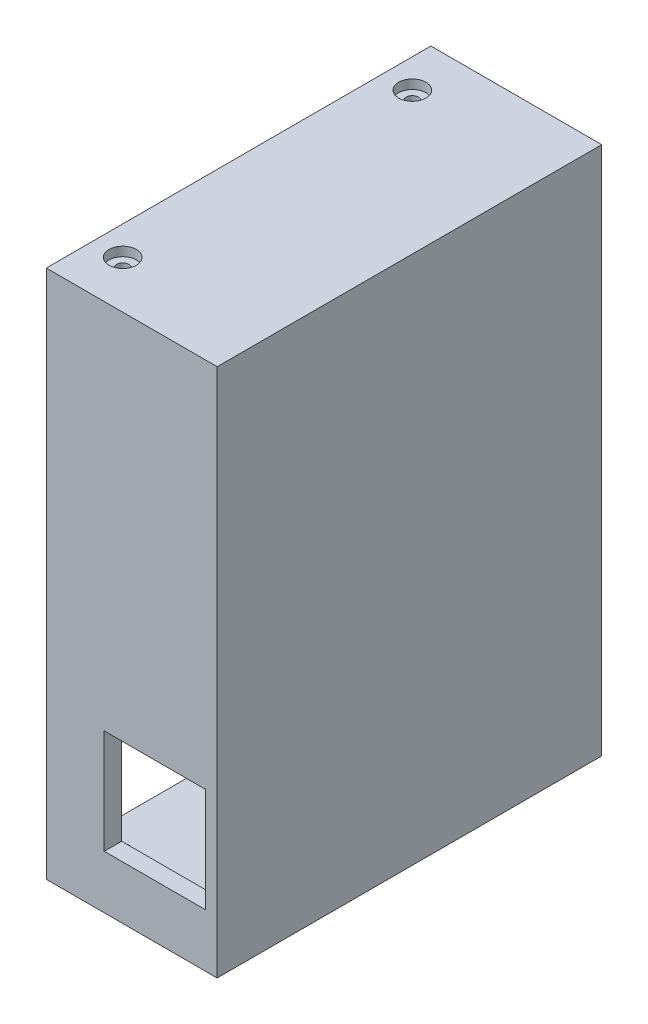
ISO-10303-21;
HEADER;
FILE_DESCRIPTION(('STEP AP214'),'2;1');
FILE_NAME('part.step','',(''),(''),'','','');
FILE_SCHEMA(('AUTOMOTIVE_DESIGN { 1 0 10303 214 1 1 1 1 }'));
ENDSEC;
DATA;
#1=APPLICATION_CONTEXT('core data for automotive mechanical design processes');
#2=APPLICATION_PROTOCOL_DEFINITION('international standard','automotive_design',2000,#1);
#3=PRODUCT_CONTEXT('',#1,'mechanical');
#4=PRODUCT('Part','Part','',(#3));
#5=PRODUCT_RELATED_PRODUCT_CATEGORY('part','',(#4));
#6=PRODUCT_DEFINITION_FORMATION('','',#4);
#7=PRODUCT_DEFINITION_CONTEXT('part definition',#1,'design');
#8=PRODUCT_DEFINITION('design','',#6,#7);
#9=PRODUCT_DEFINITION_SHAPE('','',#8);
#10=(LENGTH_UNIT() NAMED_UNIT(*) SI_UNIT(.MILLI.,.METRE.));
#11=(NAMED_UNIT(*) PLANE_ANGLE_UNIT() SI_UNIT($,.RADIAN.));
#12=(NAMED_UNIT(*) SI_UNIT($,.STERADIAN.) SOLID_ANGLE_UNIT());
#13=UNCERTAINTY_MEASURE_WITH_UNIT(LENGTH_MEASURE(1.E-05),#10,'distance_accuracy_value','');
#14=(GEOMETRIC_REPRESENTATION_CONTEXT(3) GLOBAL_UNCERTAINTY_ASSIGNED_CONTEXT((#13)) GLOBAL_UNIT_ASSIGNED_CONTEXT((#10,
#11,#12)) REPRESENTATION_CONTEXT('',''));
#15=CARTESIAN_POINT('',(0.,0.,0.));
#16=DIRECTION('',(0.,0.,1.));
#17=DIRECTION('',(1.,0.,0.));
#18=AXIS2_PLACEMENT_3D('',#15,#16,#17);
#19=CARTESIAN_POINT('',(2.54,58.035000008,42.160000008));
#20=DIRECTION('',(0.,0.,-1.));
#21=DIRECTION('',(0.,1.,0.));
#22=AXIS2_PLACEMENT_3D('',#19,#20,#21);
#23=PLANE('',#22);
#24=DIRECTION('',(-1.,0.,0.));
#25=VECTOR('',#24,1.);
#26=CARTESIAN_POINT('',(2.54,58.035000008,42.160000008));
#27=LINE('',#26,#25);
#28=CARTESIAN_POINT('',(2.54,58.035000008,42.160000008));
#29=VERTEX_POINT('',#28);
#30=CARTESIAN_POINT('',(-34.925,58.035000008,42.160000008));
#31=VERTEX_POINT('',#30);
#32=EDGE_CURVE('E351',#29,#31,#27,.T.);
#33=ORIENTED_EDGE('',*,*,#32,.T.);
#34=DIRECTION('',(0.,1.,0.));
#35=VECTOR('',#34,1.);
#36=CARTESIAN_POINT('',(-34.925,-58.035000008,42.160000008));
#37=LINE('',#36,#35);
#38=CARTESIAN_POINT('',(-34.925,-58.035000008,42.160000008));
#39=VERTEX_POINT('',#38);
#40=EDGE_CURVE('E302',#39,#31,#37,.T.);
#41=ORIENTED_EDGE('',*,*,#40,.F.);
#42=DIRECTION('',(-1.,0.,0.));
#43=VECTOR('',#42,1.);
#44=CARTESIAN_POINT('',(2.54,-58.035000008,42.160000008));
#45=LINE('',#44,#43);
#46=CARTESIAN_POINT('',(2.54,-58.035000008,42.160000008));
#47=VERTEX_POINT('',#46);
#48=EDGE_CURVE('E349',#47,#39,#45,.T.);
#49=ORIENTED_EDGE('',*,*,#48,.F.);
#50=DIRECTION('',(0.,-1.,0.));
#51=VECTOR('',#50,1.);
#52=CARTESIAN_POINT('',(2.54,58.035000008,42.160000008));
#53=LINE('',#52,#51);
#54=EDGE_CURVE('E339',#29,#47,#53,.T.);
#55=ORIENTED_EDGE('',*,*,#54,.F.);
#56=EDGE_LOOP('',(#33,#41,#49,#55));
#57=FACE_BOUND('',#56,.T.);
#58=DIRECTION('',(0.,1.,0.));
#59=VECTOR('',#58,1.);
#60=CARTESIAN_POINT('',(0.,-23.495,42.160000008));
#61=LINE('',#60,#59);
#62=CARTESIAN_POINT('',(0.,-46.355,42.160000008));
#63=VERTEX_POINT('',#62);
#64=CARTESIAN_POINT('',(0.,-23.495,42.160000008));
#65=VERTEX_POINT('',#64);
#66=EDGE_CURVE('E175',#63,#65,#61,.T.);
#67=ORIENTED_EDGE('',*,*,#66,.F.);
#68=DIRECTION('',(1.,0.,0.));
#69=VECTOR('',#68,1.);
#70=CARTESIAN_POINT('',(0.,-46.355,42.160000008));
#71=LINE('',#70,#69);
#72=CARTESIAN_POINT('',(-22.225,-46.355,42.160000008));
#73=VERTEX_POINT('',#72);
#74=EDGE_CURVE('E198',#73,#63,#71,.T.);
#75=ORIENTED_EDGE('',*,*,#74,.F.);
#76=DIRECTION('',(0.,-1.,0.));
#77=VECTOR('',#76,1.);
#78=CARTESIAN_POINT('',(-22.225,-23.495,42.160000008));
#79=LINE('',#78,#77);
#80=CARTESIAN_POINT('',(-22.225,-23.495,42.160000008));
#81=VERTEX_POINT('',#80);
#82=EDGE_CURVE('E196',#81,#73,#79,.T.);
#83=ORIENTED_EDGE('',*,*,#82,.F.);
#84=DIRECTION('',(-1.,0.,0.));
#85=VECTOR('',#84,1.);
#86=CARTESIAN_POINT('',(0.,-23.495,42.160000008));
#87=LINE('',#86,#85);
#88=EDGE_CURVE('E184',#65,#81,#87,.T.);
#89=ORIENTED_EDGE('',*,*,#88,.F.);
#90=EDGE_LOOP('',(#67,#75,#83,#89));
#91=FACE_BOUND('',#90,.T.);
#92=ADVANCED_FACE('F39',(#57,#91),#23,.F.);
#93=CARTESIAN_POINT('',(-178.389655251433,-54.225000008,38.350000008));
#94=DIRECTION('',(0.,0.,-1.));
#95=DIRECTION('',(0.,1.,0.));
#96=AXIS2_PLACEMENT_3D('',#93,#94,#95);
#97=PLANE('',#96);
#98=DIRECTION('',(0.,1.,0.));
#99=VECTOR('',#98,1.);
#100=CARTESIAN_POINT('',(0.,-54.225000008,38.350000008));
#101=LINE('',#100,#99);
#102=CARTESIAN_POINT('',(0.,-23.495,38.350000008));
#103=VERTEX_POINT('',#102);
#104=CARTESIAN_POINT('',(0.,54.225000008,38.350000008));
#105=VERTEX_POINT('',#104);
#106=EDGE_CURVE('E316',#103,#105,#101,.T.);
#107=ORIENTED_EDGE('',*,*,#106,.F.);
#108=DIRECTION('',(-1.,0.,0.));
#109=VECTOR('',#108,1.);
#110=CARTESIAN_POINT('',(-178.389655251433,-23.495,38.350000008));
#111=LINE('',#110,#109);
#112=CARTESIAN_POINT('',(-22.225,-23.495,38.350000008));
#113=VERTEX_POINT('',#112);
#114=EDGE_CURVE('E191',#103,#113,#111,.T.);
#115=ORIENTED_EDGE('',*,*,#114,.T.);
#116=DIRECTION('',(0.,-1.,0.));
#117=VECTOR('',#116,1.);
#118=CARTESIAN_POINT('',(-22.225,-54.225000008,38.350000008));
#119=LINE('',#118,#117);
#120=CARTESIAN_POINT('',(-22.225,-46.355,38.350000008));
#121=VERTEX_POINT('',#120);
#122=EDGE_CURVE('E11',#113,#121,#119,.T.);
#123=ORIENTED_EDGE('',*,*,#122,.T.);
#124=DIRECTION('',(1.,0.,0.));
#125=VECTOR('',#124,1.);
#126=CARTESIAN_POINT('',(-178.389655251433,-46.355,38.350000008));
#127=LINE('',#126,#125);
#128=CARTESIAN_POINT('',(0.,-46.355,38.350000008));
#129=VERTEX_POINT('',#128);
#130=EDGE_CURVE('E192',#121,#129,#127,.T.);
#131=ORIENTED_EDGE('',*,*,#130,.T.);
#132=CARTESIAN_POINT('',(0.,-54.225000008,38.350000008));
#133=VERTEX_POINT('',#132);
#134=EDGE_CURVE('E317',#133,#129,#101,.T.);
#135=ORIENTED_EDGE('',*,*,#134,.F.);
#136=DIRECTION('',(1.,0.,0.));
#137=VECTOR('',#136,1.);
#138=CARTESIAN_POINT('',(-178.389655251433,-54.225000008,38.350000008));
#139=LINE('',#138,#137);
#140=CARTESIAN_POINT('',(-34.925,-54.225000008,38.350000008));
#141=VERTEX_POINT('',#140);
#142=EDGE_CURVE('E327',#141,#133,#139,.T.);
#143=ORIENTED_EDGE('',*,*,#142,.F.);
#144=DIRECTION('',(0.,1.,0.));
#145=VECTOR('',#144,1.);
#146=CARTESIAN_POINT('',(-34.925,-54.225000008,38.350000008));
#147=LINE('',#146,#145);
#148=CARTESIAN_POINT('',(-34.925,54.225000008,38.350000008));
#149=VERTEX_POINT('',#148);
#150=EDGE_CURVE('E286',#141,#149,#147,.T.);
#151=ORIENTED_EDGE('',*,*,#150,.T.);
#152=DIRECTION('',(1.,0.,0.));
#153=VECTOR('',#152,1.);
#154=CARTESIAN_POINT('',(-178.389655251433,54.225000008,38.350000008));
#155=LINE('',#154,#153);
#156=EDGE_CURVE('E324',#149,#105,#155,.T.);
#157=ORIENTED_EDGE('',*,*,#156,.T.);
#158=EDGE_LOOP('',(#107,#115,#123,#131,#135,#143,#151,#157));
#159=FACE_BOUND('',#158,.T.);
#160=ADVANCED_FACE('F407',(#159),#97,.T.);
#161=CARTESIAN_POINT('',(2.54,-58.035000008,-42.160000008));
#162=DIRECTION('',(0.,1.,0.));
#163=DIRECTION('',(0.,0.,1.));
#164=AXIS2_PLACEMENT_3D('',#161,#162,#163);
#165=PLANE('',#164);
#166=ORIENTED_EDGE('',*,*,#48,.T.);
#167=DIRECTION('',(0.,0.,1.));
#168=VECTOR('',#167,1.);
#169=CARTESIAN_POINT('',(-34.925,-58.035000008,-42.160000008));
#170=LINE('',#169,#168);
#171=CARTESIAN_POINT('',(-34.925,-58.035000008,-42.160000008));
#172=VERTEX_POINT('',#171);
#173=EDGE_CURVE('E305',#172,#39,#170,.T.);
#174=ORIENTED_EDGE('',*,*,#173,.F.);
#175=DIRECTION('',(-1.,0.,0.));
#176=VECTOR('',#175,1.);
#177=CARTESIAN_POINT('',(2.54,-58.035000008,-42.160000008));
#178=LINE('',#177,#176);
#179=CARTESIAN_POINT('',(2.54,-58.035000008,-42.160000008));
#180=VERTEX_POINT('',#179);
#181=EDGE_CURVE('E347',#180,#172,#178,.T.);
#182=ORIENTED_EDGE('',*,*,#181,.F.);
#183=DIRECTION('',(0.,0.,-1.));
#184=VECTOR('',#183,1.);
#185=CARTESIAN_POINT('',(2.54,-58.035000008,-42.160000008));
#186=LINE('',#185,#184);
#187=EDGE_CURVE('E341',#47,#180,#186,.T.);
#188=ORIENTED_EDGE('',*,*,#187,.F.);
#189=EDGE_LOOP('',(#166,#174,#182,#188));
#190=FACE_BOUND('',#189,.T.);
#191=CARTESIAN_POINT('',(-28.575,-58.035000008,-31.75));
#192=DIRECTION('',(0.,-1.,0.));
#193=DIRECTION('',(0.,0.,-1.));
#194=AXIS2_PLACEMENT_3D('',#191,#192,#193);
#195=CIRCLE('',#194,2.999999969);
#196=CARTESIAN_POINT('',(-28.575,-58.035000008,-34.749999969));
#197=VERTEX_POINT('',#196);
#198=EDGE_CURVE('E267',#197,#197,#195,.T.);
#199=ORIENTED_EDGE('',*,*,#198,.F.);
#200=EDGE_LOOP('',(#199));
#201=FACE_BOUND('',#200,.T.);
#202=CARTESIAN_POINT('',(-28.575,-58.035000008,31.75));
#203=DIRECTION('',(0.,-1.,0.));
#204=DIRECTION('',(0.,0.,-1.));
#205=AXIS2_PLACEMENT_3D('',#202,#203,#204);
#206=CIRCLE('',#205,2.999999969);
#207=CARTESIAN_POINT('',(-28.575,-58.035000008,28.750000031));
#208=VERTEX_POINT('',#207);
#209=EDGE_CURVE('E264',#208,#208,#206,.T.);
#210=ORIENTED_EDGE('',*,*,#209,.F.);
#211=EDGE_LOOP('',(#210));
#212=FACE_BOUND('',#211,.T.);
#213=DIRECTION('',(0.,0.,1.));
#214=VECTOR('',#213,1.);
#215=CARTESIAN_POINT('',(0.,-58.035000008,0.));
#216=LINE('',#215,#214);
#217=CARTESIAN_POINT('',(0.,-58.035000008,-25.4));
#218=VERTEX_POINT('',#217);
#219=CARTESIAN_POINT('',(0.,-58.035000008,0.));
#220=VERTEX_POINT('',#219);
#221=EDGE_CURVE('E207',#218,#220,#216,.T.);
#222=ORIENTED_EDGE('',*,*,#221,.F.);
#223=DIRECTION('',(1.,0.,0.));
#224=VECTOR('',#223,1.);
#225=CARTESIAN_POINT('',(0.,-58.035000008,-25.4));
#226=LINE('',#225,#224);
#227=CARTESIAN_POINT('',(-22.225,-58.035000008,-25.4));
#228=VERTEX_POINT('',#227);
#229=EDGE_CURVE('E214',#228,#218,#226,.T.);
#230=ORIENTED_EDGE('',*,*,#229,.F.);
#231=DIRECTION('',(0.,0.,-1.));
#232=VECTOR('',#231,1.);
#233=CARTESIAN_POINT('',(-22.225,-58.035000008,0.));
#234=LINE('',#233,#232);
#235=CARTESIAN_POINT('',(-22.225,-58.035000008,0.));
#236=VERTEX_POINT('',#235);
#237=EDGE_CURVE('E211',#236,#228,#234,.T.);
#238=ORIENTED_EDGE('',*,*,#237,.F.);
#239=DIRECTION('',(-1.,0.,0.));
#240=VECTOR('',#239,1.);
#241=CARTESIAN_POINT('',(0.,-58.035000008,0.));
#242=LINE('',#241,#240);
#243=EDGE_CURVE('E209',#220,#236,#242,.T.);
#244=ORIENTED_EDGE('',*,*,#243,.F.);
#245=EDGE_LOOP('',(#222,#230,#238,#244));
#246=FACE_BOUND('',#245,.T.);
#247=ADVANCED_FACE('F390',(#190,#201,#212,#246),#165,.F.);
#248=CARTESIAN_POINT('',(-178.389655251433,-54.225000008,-38.350000008));
#249=DIRECTION('',(0.,1.,0.));
#250=DIRECTION('',(0.,0.,1.));
#251=AXIS2_PLACEMENT_3D('',#248,#249,#250);
#252=PLANE('',#251);
#253=CARTESIAN_POINT('',(-28.575,-54.225000008,31.75));
#254=DIRECTION('',(0.,1.,0.));
#255=DIRECTION('',(0.,0.,1.));
#256=AXIS2_PLACEMENT_3D('',#253,#254,#255);
#257=CIRCLE('',#256,1.349999967);
#258=CARTESIAN_POINT('',(-28.575,-54.225000008,33.099999967));
#259=VERTEX_POINT('',#258);
#260=EDGE_CURVE('E290',#259,#259,#257,.F.);
#261=ORIENTED_EDGE('',*,*,#260,.T.);
#262=EDGE_LOOP('',(#261));
#263=FACE_BOUND('',#262,.T.);
#264=CARTESIAN_POINT('',(-28.575,-54.225000008,-31.75));
#265=DIRECTION('',(0.,1.,0.));
#266=DIRECTION('',(0.,0.,1.));
#267=AXIS2_PLACEMENT_3D('',#264,#265,#266);
#268=CIRCLE('',#267,1.349999967);
#269=CARTESIAN_POINT('',(-28.575,-54.225000008,-30.400000033));
#270=VERTEX_POINT('',#269);
#271=EDGE_CURVE('E354',#270,#270,#268,.F.);
#272=ORIENTED_EDGE('',*,*,#271,.T.);
#273=EDGE_LOOP('',(#272));
#274=FACE_BOUND('',#273,.T.);
#275=DIRECTION('',(0.,0.,1.));
#276=VECTOR('',#275,1.);
#277=CARTESIAN_POINT('',(0.,-54.225000008,-38.350000008));
#278=LINE('',#277,#276);
#279=CARTESIAN_POINT('',(0.,-54.225000008,0.));
#280=VERTEX_POINT('',#279);
#281=EDGE_CURVE('E312',#280,#133,#278,.T.);
#282=ORIENTED_EDGE('',*,*,#281,.F.);
#283=DIRECTION('',(-1.,0.,0.));
#284=VECTOR('',#283,1.);
#285=CARTESIAN_POINT('',(-178.389655251433,-54.225000008,0.));
#286=LINE('',#285,#284);
#287=CARTESIAN_POINT('',(-22.225,-54.225000008,0.));
#288=VERTEX_POINT('',#287);
#289=EDGE_CURVE('E230',#280,#288,#286,.T.);
#290=ORIENTED_EDGE('',*,*,#289,.T.);
#291=DIRECTION('',(0.,0.,-1.));
#292=VECTOR('',#291,1.);
#293=CARTESIAN_POINT('',(-22.225,-54.225000008,-38.350000008));
#294=LINE('',#293,#292);
#295=CARTESIAN_POINT('',(-22.225,-54.225000008,-25.4));
#296=VERTEX_POINT('',#295);
#297=EDGE_CURVE('E47',#288,#296,#294,.T.);
#298=ORIENTED_EDGE('',*,*,#297,.T.);
#299=DIRECTION('',(1.,0.,0.));
#300=VECTOR('',#299,1.);
#301=CARTESIAN_POINT('',(-178.389655251433,-54.225000008,-25.4));
#302=LINE('',#301,#300);
#303=CARTESIAN_POINT('',(0.,-54.225000008,-25.4));
#304=VERTEX_POINT('',#303);
#305=EDGE_CURVE('E227',#296,#304,#302,.T.);
#306=ORIENTED_EDGE('',*,*,#305,.T.);
#307=CARTESIAN_POINT('',(0.,-54.225000008,-38.350000008));
#308=VERTEX_POINT('',#307);
#309=EDGE_CURVE('E313',#308,#304,#278,.T.);
#310=ORIENTED_EDGE('',*,*,#309,.F.);
#311=DIRECTION('',(1.,0.,0.));
#312=VECTOR('',#311,1.);
#313=CARTESIAN_POINT('',(-178.389655251433,-54.225000008,-38.350000008));
#314=LINE('',#313,#312);
#315=CARTESIAN_POINT('',(-34.925,-54.225000008,-38.350000008));
#316=VERTEX_POINT('',#315);
#317=EDGE_CURVE('E330',#316,#308,#314,.T.);
#318=ORIENTED_EDGE('',*,*,#317,.F.);
#319=DIRECTION('',(0.,0.,1.));
#320=VECTOR('',#319,1.);
#321=CARTESIAN_POINT('',(-34.925,-54.225000008,-38.350000008));
#322=LINE('',#321,#320);
#323=EDGE_CURVE('E289',#316,#141,#322,.T.);
#324=ORIENTED_EDGE('',*,*,#323,.T.);
#325=ORIENTED_EDGE('',*,*,#142,.T.);
#326=EDGE_LOOP('',(#282,#290,#298,#306,#310,#318,#324,#325));
#327=FACE_BOUND('',#326,.T.);
#328=ADVANCED_FACE('F378',(#263,#274,#327),#252,.T.);
#329=CARTESIAN_POINT('',(2.54,58.035000008,-42.160000008));
#330=DIRECTION('',(0.,0.,1.));
#331=DIRECTION('',(0.,-1.,0.));
#332=AXIS2_PLACEMENT_3D('',#329,#330,#331);
#333=PLANE('',#332);
#334=ORIENTED_EDGE('',*,*,#181,.T.);
#335=DIRECTION('',(0.,-1.,0.));
#336=VECTOR('',#335,1.);
#337=CARTESIAN_POINT('',(-34.925,-58.035000008,-42.160000008));
#338=LINE('',#337,#336);
#339=CARTESIAN_POINT('',(-34.925,58.035000008,-42.160000008));
#340=VERTEX_POINT('',#339);
#341=EDGE_CURVE('E296',#340,#172,#338,.T.);
#342=ORIENTED_EDGE('',*,*,#341,.F.);
#343=DIRECTION('',(-1.,0.,0.));
#344=VECTOR('',#343,1.);
#345=CARTESIAN_POINT('',(2.54,58.035000008,-42.160000008));
#346=LINE('',#345,#344);
#347=CARTESIAN_POINT('',(2.54,58.035000008,-42.160000008));
#348=VERTEX_POINT('',#347);
#349=EDGE_CURVE('E345',#348,#340,#346,.T.);
#350=ORIENTED_EDGE('',*,*,#349,.F.);
#351=DIRECTION('',(0.,1.,0.));
#352=VECTOR('',#351,1.);
#353=CARTESIAN_POINT('',(2.54,58.035000008,-42.160000008));
#354=LINE('',#353,#352);
#355=EDGE_CURVE('E343',#180,#348,#354,.T.);
#356=ORIENTED_EDGE('',*,*,#355,.F.);
#357=EDGE_LOOP('',(#334,#342,#350,#356));
#358=FACE_BOUND('',#357,.T.);
#359=DIRECTION('',(0.,-1.,0.));
#360=VECTOR('',#359,1.);
#361=CARTESIAN_POINT('',(0.,-46.355,-42.160000008));
#362=LINE('',#361,#360);
#363=CARTESIAN_POINT('',(0.,-23.495,-42.160000008));
#364=VERTEX_POINT('',#363);
#365=CARTESIAN_POINT('',(0.,-46.355,-42.160000008));
#366=VERTEX_POINT('',#365);
#367=EDGE_CURVE('E233',#364,#366,#362,.T.);
#368=ORIENTED_EDGE('',*,*,#367,.F.);
#369=DIRECTION('',(1.,0.,0.));
#370=VECTOR('',#369,1.);
#371=CARTESIAN_POINT('',(0.,-23.495,-42.160000008));
#372=LINE('',#371,#370);
#373=CARTESIAN_POINT('',(-22.225,-23.495,-42.160000008));
#374=VERTEX_POINT('',#373);
#375=EDGE_CURVE('E240',#374,#364,#372,.T.);
#376=ORIENTED_EDGE('',*,*,#375,.F.);
#377=DIRECTION('',(0.,1.,0.));
#378=VECTOR('',#377,1.);
#379=CARTESIAN_POINT('',(-22.225,-46.355,-42.160000008));
#380=LINE('',#379,#378);
#381=CARTESIAN_POINT('',(-22.225,-46.355,-42.160000008));
#382=VERTEX_POINT('',#381);
#383=EDGE_CURVE('E237',#382,#374,#380,.T.);
#384=ORIENTED_EDGE('',*,*,#383,.F.);
#385=DIRECTION('',(-1.,0.,0.));
#386=VECTOR('',#385,1.);
#387=CARTESIAN_POINT('',(0.,-46.355,-42.160000008));
#388=LINE('',#387,#386);
#389=EDGE_CURVE('E235',#366,#382,#388,.T.);
#390=ORIENTED_EDGE('',*,*,#389,.F.);
#391=EDGE_LOOP('',(#368,#376,#384,#390));
#392=FACE_BOUND('',#391,.T.);
#393=ADVANCED_FACE('F426',(#358,#392),#333,.F.);
#394=CARTESIAN_POINT('',(-178.389655251433,-54.225000008,-38.350000008));
#395=DIRECTION('',(0.,0.,1.));
#396=DIRECTION('',(0.,-1.,0.));
#397=AXIS2_PLACEMENT_3D('',#394,#395,#396);
#398=PLANE('',#397);
#399=DIRECTION('',(0.,-1.,0.));
#400=VECTOR('',#399,1.);
#401=CARTESIAN_POINT('',(0.,-54.225000008,-38.350000008));
#402=LINE('',#401,#400);
#403=CARTESIAN_POINT('',(0.,-46.355,-38.350000008));
#404=VERTEX_POINT('',#403);
#405=EDGE_CURVE('E308',#404,#308,#402,.T.);
#406=ORIENTED_EDGE('',*,*,#405,.F.);
#407=DIRECTION('',(-1.,0.,0.));
#408=VECTOR('',#407,1.);
#409=CARTESIAN_POINT('',(-178.389655251433,-46.355,-38.350000008));
#410=LINE('',#409,#408);
#411=CARTESIAN_POINT('',(-22.225,-46.355,-38.350000008));
#412=VERTEX_POINT('',#411);
#413=EDGE_CURVE('E256',#404,#412,#410,.T.);
#414=ORIENTED_EDGE('',*,*,#413,.T.);
#415=DIRECTION('',(0.,1.,0.));
#416=VECTOR('',#415,1.);
#417=CARTESIAN_POINT('',(-22.225,-54.225000008,-38.350000008));
#418=LINE('',#417,#416);
#419=CARTESIAN_POINT('',(-22.225,-23.495,-38.350000008));
#420=VERTEX_POINT('',#419);
#421=EDGE_CURVE('E353',#412,#420,#418,.T.);
#422=ORIENTED_EDGE('',*,*,#421,.T.);
#423=DIRECTION('',(1.,0.,0.));
#424=VECTOR('',#423,1.);
#425=CARTESIAN_POINT('',(-178.389655251433,-23.495,-38.350000008));
#426=LINE('',#425,#424);
#427=CARTESIAN_POINT('',(0.,-23.495,-38.350000008));
#428=VERTEX_POINT('',#427);
#429=EDGE_CURVE('E253',#420,#428,#426,.T.);
#430=ORIENTED_EDGE('',*,*,#429,.T.);
#431=CARTESIAN_POINT('',(0.,54.225000008,-38.350000008));
#432=VERTEX_POINT('',#431);
#433=EDGE_CURVE('E309',#432,#428,#402,.T.);
#434=ORIENTED_EDGE('',*,*,#433,.F.);
#435=DIRECTION('',(1.,0.,0.));
#436=VECTOR('',#435,1.);
#437=CARTESIAN_POINT('',(-178.389655251433,54.225000008,-38.350000008));
#438=LINE('',#437,#436);
#439=CARTESIAN_POINT('',(-34.925,54.225000008,-38.350000008));
#440=VERTEX_POINT('',#439);
#441=EDGE_CURVE('E322',#440,#432,#438,.T.);
#442=ORIENTED_EDGE('',*,*,#441,.F.);
#443=DIRECTION('',(0.,-1.,0.));
#444=VECTOR('',#443,1.);
#445=CARTESIAN_POINT('',(-34.925,-54.225000008,-38.350000008));
#446=LINE('',#445,#444);
#447=EDGE_CURVE('E293',#440,#316,#446,.T.);
#448=ORIENTED_EDGE('',*,*,#447,.T.);
#449=ORIENTED_EDGE('',*,*,#317,.T.);
#450=EDGE_LOOP('',(#406,#414,#422,#430,#434,#442,#448,#449));
#451=FACE_BOUND('',#450,.T.);
#452=ADVANCED_FACE('F398',(#451),#398,.T.);
#453=CARTESIAN_POINT('',(-28.575,-58.035000008,-31.75));
#454=DIRECTION('',(0.,1.,0.));
#455=DIRECTION('',(0.,0.,1.));
#456=AXIS2_PLACEMENT_3D('',#453,#454,#455);
#457=CYLINDRICAL_SURFACE('',#456,1.349999967);
#458=ORIENTED_EDGE('',*,*,#271,.F.);
#459=EDGE_LOOP('',(#458));
#460=FACE_BOUND('',#459,.T.);
#461=CARTESIAN_POINT('',(-28.575,-56.034999944,-31.75));
#462=DIRECTION('',(0.,-1.,0.));
#463=DIRECTION('',(0.,0.,-1.));
#464=AXIS2_PLACEMENT_3D('',#461,#462,#463);
#465=CIRCLE('',#464,1.349999967);
#466=CARTESIAN_POINT('',(-28.575,-56.034999944,-33.099999967));
#467=VERTEX_POINT('',#466);
#468=EDGE_CURVE('E285',#467,#467,#465,.T.);
#469=ORIENTED_EDGE('',*,*,#468,.T.);
#470=EDGE_LOOP('',(#469));
#471=FACE_BOUND('',#470,.T.);
#472=ADVANCED_FACE('F465',(#460,#471),#457,.F.);
#473=CARTESIAN_POINT('',(-28.575,-58.035000008,31.75));
#474=DIRECTION('',(0.,1.,0.));
#475=DIRECTION('',(0.,0.,1.));
#476=AXIS2_PLACEMENT_3D('',#473,#474,#475);
#477=CYLINDRICAL_SURFACE('',#476,1.349999967);
#478=ORIENTED_EDGE('',*,*,#260,.F.);
#479=EDGE_LOOP('',(#478));
#480=FACE_BOUND('',#479,.T.);
#481=CARTESIAN_POINT('',(-28.575,-56.034999944,31.75));
#482=DIRECTION('',(0.,-1.,0.));
#483=DIRECTION('',(0.,0.,-1.));
#484=AXIS2_PLACEMENT_3D('',#481,#482,#483);
#485=CIRCLE('',#484,1.349999967);
#486=CARTESIAN_POINT('',(-28.575,-56.034999944,30.400000033));
#487=VERTEX_POINT('',#486);
#488=EDGE_CURVE('E263',#487,#487,#485,.T.);
#489=ORIENTED_EDGE('',*,*,#488,.T.);
#490=EDGE_LOOP('',(#489));
#491=FACE_BOUND('',#490,.T.);
#492=ADVANCED_FACE('F476',(#480,#491),#477,.F.);
#493=CARTESIAN_POINT('',(-28.575,58.035000008,31.75));
#494=DIRECTION('',(0.,-1.,0.));
#495=DIRECTION('',(0.,0.,-1.));
#496=AXIS2_PLACEMENT_3D('',#493,#494,#495);
#497=CYLINDRICAL_SURFACE('',#496,1.349999967);
#498=CARTESIAN_POINT('',(-28.575,54.225000008,31.75));
#499=DIRECTION('',(0.,-1.,0.));
#500=DIRECTION('',(0.,0.,-1.));
#501=AXIS2_PLACEMENT_3D('',#498,#499,#500);
#502=CIRCLE('',#501,1.349999967);
#503=CARTESIAN_POINT('',(-28.575,54.225000008,30.400000033));
#504=VERTEX_POINT('',#503);
#505=EDGE_CURVE('E360',#504,#504,#502,.F.);
#506=ORIENTED_EDGE('',*,*,#505,.F.);
#507=EDGE_LOOP('',(#506));
#508=FACE_BOUND('',#507,.T.);
#509=CARTESIAN_POINT('',(-28.575,56.034999944,31.75));
#510=DIRECTION('',(0.,1.,0.));
#511=DIRECTION('',(0.,0.,1.));
#512=AXIS2_PLACEMENT_3D('',#509,#510,#511);
#513=CIRCLE('',#512,1.349999967);
#514=CARTESIAN_POINT('',(-28.575,56.034999944,33.099999967));
#515=VERTEX_POINT('',#514);
#516=EDGE_CURVE('E363',#515,#515,#513,.T.);
#517=ORIENTED_EDGE('',*,*,#516,.T.);
#518=EDGE_LOOP('',(#517));
#519=FACE_BOUND('',#518,.T.);
#520=ADVANCED_FACE('F480',(#508,#519),#497,.F.);
#521=CARTESIAN_POINT('',(-28.575,58.035000008,-31.75));
#522=DIRECTION('',(0.,-1.,0.));
#523=DIRECTION('',(0.,0.,-1.));
#524=AXIS2_PLACEMENT_3D('',#521,#522,#523);
#525=CYLINDRICAL_SURFACE('',#524,1.349999967);
#526=CARTESIAN_POINT('',(-28.575,54.225000008,-31.75));
#527=DIRECTION('',(0.,-1.,0.));
#528=DIRECTION('',(0.,0.,-1.));
#529=AXIS2_PLACEMENT_3D('',#526,#527,#528);
#530=CIRCLE('',#529,1.349999967);
#531=CARTESIAN_POINT('',(-28.575,54.225000008,-33.099999967));
#532=VERTEX_POINT('',#531);
#533=EDGE_CURVE('E357',#532,#532,#530,.F.);
#534=ORIENTED_EDGE('',*,*,#533,.F.);
#535=EDGE_LOOP('',(#534));
#536=FACE_BOUND('',#535,.T.);
#537=CARTESIAN_POINT('',(-28.575,56.034999944,-31.75));
#538=DIRECTION('',(0.,1.,0.));
#539=DIRECTION('',(0.,0.,1.));
#540=AXIS2_PLACEMENT_3D('',#537,#538,#539);
#541=CIRCLE('',#540,1.349999967);
#542=CARTESIAN_POINT('',(-28.575,56.034999944,-30.400000033));
#543=VERTEX_POINT('',#542);
#544=EDGE_CURVE('E275',#543,#543,#541,.T.);
#545=ORIENTED_EDGE('',*,*,#544,.T.);
#546=EDGE_LOOP('',(#545));
#547=FACE_BOUND('',#546,.T.);
#548=ADVANCED_FACE('F484',(#536,#547),#525,.F.);
#549=CARTESIAN_POINT('',(2.54,58.035000008,-42.160000008));
#550=DIRECTION('',(0.,-1.,0.));
#551=DIRECTION('',(0.,0.,-1.));
#552=AXIS2_PLACEMENT_3D('',#549,#550,#551);
#553=PLANE('',#552);
#554=CARTESIAN_POINT('',(-28.575,58.035000008,-31.75));
#555=DIRECTION('',(0.,1.,0.));
#556=DIRECTION('',(0.,0.,1.));
#557=AXIS2_PLACEMENT_3D('',#554,#555,#556);
#558=CIRCLE('',#557,2.999999969);
#559=CARTESIAN_POINT('',(-28.575,58.035000008,-28.750000031));
#560=VERTEX_POINT('',#559);
#561=EDGE_CURVE('E276',#560,#560,#558,.T.);
#562=ORIENTED_EDGE('',*,*,#561,.F.);
#563=EDGE_LOOP('',(#562));
#564=FACE_BOUND('',#563,.T.);
#565=CARTESIAN_POINT('',(-28.575,58.035000008,31.75));
#566=DIRECTION('',(0.,1.,0.));
#567=DIRECTION('',(0.,0.,1.));
#568=AXIS2_PLACEMENT_3D('',#565,#566,#567);
#569=CIRCLE('',#568,2.999999969);
#570=CARTESIAN_POINT('',(-28.575,58.035000008,34.749999969));
#571=VERTEX_POINT('',#570);
#572=EDGE_CURVE('E279',#571,#571,#569,.T.);
#573=ORIENTED_EDGE('',*,*,#572,.F.);
#574=EDGE_LOOP('',(#573));
#575=FACE_BOUND('',#574,.T.);
#576=ORIENTED_EDGE('',*,*,#349,.T.);
#577=DIRECTION('',(0.,0.,-1.));
#578=VECTOR('',#577,1.);
#579=CARTESIAN_POINT('',(-34.925,58.035000008,-42.160000008));
#580=LINE('',#579,#578);
#581=EDGE_CURVE('E299',#31,#340,#580,.T.);
#582=ORIENTED_EDGE('',*,*,#581,.F.);
#583=ORIENTED_EDGE('',*,*,#32,.F.);
#584=DIRECTION('',(0.,0.,1.));
#585=VECTOR('',#584,1.);
#586=CARTESIAN_POINT('',(2.54,58.035000008,-42.160000008));
#587=LINE('',#586,#585);
#588=EDGE_CURVE('E336',#348,#29,#587,.T.);
#589=ORIENTED_EDGE('',*,*,#588,.F.);
#590=EDGE_LOOP('',(#576,#582,#583,#589));
#591=FACE_BOUND('',#590,.T.);
#592=ADVANCED_FACE('F41',(#564,#575,#591),#553,.F.);
#593=CARTESIAN_POINT('',(2.54,0.,0.));
#594=DIRECTION('',(1.,0.,0.));
#595=DIRECTION('',(0.,0.,-1.));
#596=AXIS2_PLACEMENT_3D('',#593,#594,#595);
#597=PLANE('',#596);
#598=ORIENTED_EDGE('',*,*,#588,.T.);
#599=ORIENTED_EDGE('',*,*,#54,.T.);
#600=ORIENTED_EDGE('',*,*,#187,.T.);
#601=ORIENTED_EDGE('',*,*,#355,.T.);
#602=EDGE_LOOP('',(#598,#599,#600,#601));
#603=FACE_BOUND('',#602,.T.);
#604=ADVANCED_FACE('F460',(#603),#597,.T.);
#605=CARTESIAN_POINT('',(-178.389655251433,54.225000008,-38.350000008));
#606=DIRECTION('',(0.,-1.,0.));
#607=DIRECTION('',(0.,0.,-1.));
#608=AXIS2_PLACEMENT_3D('',#605,#606,#607);
#609=PLANE('',#608);
#610=ORIENTED_EDGE('',*,*,#533,.T.);
#611=EDGE_LOOP('',(#610));
#612=FACE_BOUND('',#611,.T.);
#613=ORIENTED_EDGE('',*,*,#505,.T.);
#614=EDGE_LOOP('',(#613));
#615=FACE_BOUND('',#614,.T.);
#616=ORIENTED_EDGE('',*,*,#156,.F.);
#617=DIRECTION('',(0.,0.,-1.));
#618=VECTOR('',#617,1.);
#619=CARTESIAN_POINT('',(-34.925,54.225000008,-38.350000008));
#620=LINE('',#619,#618);
#621=EDGE_CURVE('E333',#149,#440,#620,.T.);
#622=ORIENTED_EDGE('',*,*,#621,.T.);
#623=ORIENTED_EDGE('',*,*,#441,.T.);
#624=DIRECTION('',(0.,0.,-1.));
#625=VECTOR('',#624,1.);
#626=CARTESIAN_POINT('',(0.,54.225000008,-38.350000008));
#627=LINE('',#626,#625);
#628=EDGE_CURVE('E319',#105,#432,#627,.T.);
#629=ORIENTED_EDGE('',*,*,#628,.F.);
#630=EDGE_LOOP('',(#616,#622,#623,#629));
#631=FACE_BOUND('',#630,.T.);
#632=ADVANCED_FACE('F415',(#612,#615,#631),#609,.T.);
#633=CARTESIAN_POINT('',(-34.925,0.,0.));
#634=DIRECTION('',(-1.,0.,0.));
#635=DIRECTION('',(0.,-1.,0.));
#636=AXIS2_PLACEMENT_3D('',#633,#634,#635);
#637=PLANE('',#636);
#638=ORIENTED_EDGE('',*,*,#447,.F.);
#639=ORIENTED_EDGE('',*,*,#621,.F.);
#640=ORIENTED_EDGE('',*,*,#150,.F.);
#641=ORIENTED_EDGE('',*,*,#323,.F.);
#642=EDGE_LOOP('',(#638,#639,#640,#641));
#643=FACE_BOUND('',#642,.T.);
#644=ORIENTED_EDGE('',*,*,#341,.T.);
#645=ORIENTED_EDGE('',*,*,#173,.T.);
#646=ORIENTED_EDGE('',*,*,#40,.T.);
#647=ORIENTED_EDGE('',*,*,#581,.T.);
#648=EDGE_LOOP('',(#644,#645,#646,#647));
#649=FACE_BOUND('',#648,.T.);
#650=ADVANCED_FACE('F402',(#643,#649),#637,.T.);
#651=CARTESIAN_POINT('',(0.,0.,0.));
#652=DIRECTION('',(1.,0.,0.));
#653=DIRECTION('',(0.,0.,-1.));
#654=AXIS2_PLACEMENT_3D('',#651,#652,#653);
#655=PLANE('',#654);
#656=ORIENTED_EDGE('',*,*,#134,.T.);
#657=DIRECTION('',(0.,0.,-1.));
#658=VECTOR('',#657,1.);
#659=CARTESIAN_POINT('',(0.,-46.355,42.160000008));
#660=LINE('',#659,#658);
#661=EDGE_CURVE('E59',#63,#129,#660,.T.);
#662=ORIENTED_EDGE('',*,*,#661,.F.);
#663=ORIENTED_EDGE('',*,*,#66,.T.);
#664=DIRECTION('',(0.,0.,-1.));
#665=VECTOR('',#664,1.);
#666=CARTESIAN_POINT('',(0.,-23.495,42.160000008));
#667=LINE('',#666,#665);
#668=EDGE_CURVE('E179',#65,#103,#667,.T.);
#669=ORIENTED_EDGE('',*,*,#668,.T.);
#670=ORIENTED_EDGE('',*,*,#106,.T.);
#671=ORIENTED_EDGE('',*,*,#628,.T.);
#672=ORIENTED_EDGE('',*,*,#433,.T.);
#673=DIRECTION('',(0.,0.,1.));
#674=VECTOR('',#673,1.);
#675=CARTESIAN_POINT('',(0.,-23.495,-42.160000008));
#676=LINE('',#675,#674);
#677=EDGE_CURVE('E242',#364,#428,#676,.T.);
#678=ORIENTED_EDGE('',*,*,#677,.F.);
#679=ORIENTED_EDGE('',*,*,#367,.T.);
#680=DIRECTION('',(0.,0.,1.));
#681=VECTOR('',#680,1.);
#682=CARTESIAN_POINT('',(0.,-46.355,-42.160000008));
#683=LINE('',#682,#681);
#684=EDGE_CURVE('E250',#366,#404,#683,.T.);
#685=ORIENTED_EDGE('',*,*,#684,.T.);
#686=ORIENTED_EDGE('',*,*,#405,.T.);
#687=ORIENTED_EDGE('',*,*,#309,.T.);
#688=DIRECTION('',(0.,1.,0.));
#689=VECTOR('',#688,1.);
#690=CARTESIAN_POINT('',(0.,-58.035000008,-25.4));
#691=LINE('',#690,#689);
#692=EDGE_CURVE('E216',#218,#304,#691,.T.);
#693=ORIENTED_EDGE('',*,*,#692,.F.);
#694=ORIENTED_EDGE('',*,*,#221,.T.);
#695=DIRECTION('',(0.,1.,0.));
#696=VECTOR('',#695,1.);
#697=CARTESIAN_POINT('',(0.,-58.035000008,0.));
#698=LINE('',#697,#696);
#699=EDGE_CURVE('E224',#220,#280,#698,.T.);
#700=ORIENTED_EDGE('',*,*,#699,.T.);
#701=ORIENTED_EDGE('',*,*,#281,.T.);
#702=EDGE_LOOP('',(#656,#662,#663,#669,#670,#671,#672,#678,#679,#685,#686,#687,#693,#694,#700,#701));
#703=FACE_BOUND('',#702,.T.);
#704=ADVANCED_FACE('F178',(#703),#655,.F.);
#705=CARTESIAN_POINT('',(-28.575,56.034999944,-31.75));
#706=DIRECTION('',(0.,1.,0.));
#707=DIRECTION('',(0.,0.,1.));
#708=AXIS2_PLACEMENT_3D('',#705,#706,#707);
#709=CYLINDRICAL_SURFACE('',#708,2.999999969);
#710=CARTESIAN_POINT('',(-28.575,56.034999944,-31.75));
#711=DIRECTION('',(0.,1.,0.));
#712=DIRECTION('',(0.,0.,1.));
#713=AXIS2_PLACEMENT_3D('',#710,#711,#712);
#714=CIRCLE('',#713,2.999999969);
#715=CARTESIAN_POINT('',(-28.575,56.034999944,-28.750000031));
#716=VERTEX_POINT('',#715);
#717=EDGE_CURVE('E272',#716,#716,#714,.T.);
#718=ORIENTED_EDGE('',*,*,#717,.F.);
#719=EDGE_LOOP('',(#718));
#720=FACE_BOUND('',#719,.T.);
#721=ORIENTED_EDGE('',*,*,#561,.T.);
#722=EDGE_LOOP('',(#721));
#723=FACE_BOUND('',#722,.T.);
#724=ADVANCED_FACE('F459',(#720,#723),#709,.F.);
#725=CARTESIAN_POINT('',(-28.575,56.034999944,-31.75));
#726=DIRECTION('',(0.,1.,0.));
#727=DIRECTION('',(0.,0.,1.));
#728=AXIS2_PLACEMENT_3D('',#725,#726,#727);
#729=PLANE('',#728);
#730=ORIENTED_EDGE('',*,*,#544,.F.);
#731=EDGE_LOOP('',(#730));
#732=FACE_BOUND('',#731,.T.);
#733=ORIENTED_EDGE('',*,*,#717,.T.);
#734=EDGE_LOOP('',(#733));
#735=FACE_BOUND('',#734,.T.);
#736=ADVANCED_FACE('F497',(#732,#735),#729,.T.);
#737=CARTESIAN_POINT('',(-28.575,56.034999944,31.75));
#738=DIRECTION('',(0.,1.,0.));
#739=DIRECTION('',(0.,0.,1.));
#740=AXIS2_PLACEMENT_3D('',#737,#738,#739);
#741=CYLINDRICAL_SURFACE('',#740,2.999999969);
#742=CARTESIAN_POINT('',(-28.575,56.034999944,31.75));
#743=DIRECTION('',(0.,1.,0.));
#744=DIRECTION('',(0.,0.,1.));
#745=AXIS2_PLACEMENT_3D('',#742,#743,#744);
#746=CIRCLE('',#745,2.999999969);
#747=CARTESIAN_POINT('',(-28.575,56.034999944,34.749999969));
#748=VERTEX_POINT('',#747);
#749=EDGE_CURVE('E282',#748,#748,#746,.T.);
#750=ORIENTED_EDGE('',*,*,#749,.F.);
#751=EDGE_LOOP('',(#750));
#752=FACE_BOUND('',#751,.T.);
#753=ORIENTED_EDGE('',*,*,#572,.T.);
#754=EDGE_LOOP('',(#753));
#755=FACE_BOUND('',#754,.T.);
#756=ADVANCED_FACE('F493',(#752,#755),#741,.F.);
#757=CARTESIAN_POINT('',(-28.575,56.034999944,31.75));
#758=DIRECTION('',(0.,1.,0.));
#759=DIRECTION('',(0.,0.,1.));
#760=AXIS2_PLACEMENT_3D('',#757,#758,#759);
#761=PLANE('',#760);
#762=ORIENTED_EDGE('',*,*,#516,.F.);
#763=EDGE_LOOP('',(#762));
#764=FACE_BOUND('',#763,.T.);
#765=ORIENTED_EDGE('',*,*,#749,.T.);
#766=EDGE_LOOP('',(#765));
#767=FACE_BOUND('',#766,.T.);
#768=ADVANCED_FACE('F489',(#764,#767),#761,.T.);
#769=CARTESIAN_POINT('',(-28.575,-56.034999944,31.75));
#770=DIRECTION('',(0.,-1.,0.));
#771=DIRECTION('',(0.,0.,-1.));
#772=AXIS2_PLACEMENT_3D('',#769,#770,#771);
#773=CYLINDRICAL_SURFACE('',#772,2.999999969);
#774=CARTESIAN_POINT('',(-28.575,-56.034999944,31.75));
#775=DIRECTION('',(0.,-1.,0.));
#776=DIRECTION('',(0.,0.,-1.));
#777=AXIS2_PLACEMENT_3D('',#774,#775,#776);
#778=CIRCLE('',#777,2.999999969);
#779=CARTESIAN_POINT('',(-28.575,-56.034999944,28.750000031));
#780=VERTEX_POINT('',#779);
#781=EDGE_CURVE('E260',#780,#780,#778,.T.);
#782=ORIENTED_EDGE('',*,*,#781,.F.);
#783=EDGE_LOOP('',(#782));
#784=FACE_BOUND('',#783,.T.);
#785=ORIENTED_EDGE('',*,*,#209,.T.);
#786=EDGE_LOOP('',(#785));
#787=FACE_BOUND('',#786,.T.);
#788=ADVANCED_FACE('F492',(#784,#787),#773,.F.);
#789=CARTESIAN_POINT('',(-28.575,-56.034999944,31.75));
#790=DIRECTION('',(0.,-1.,0.));
#791=DIRECTION('',(0.,0.,-1.));
#792=AXIS2_PLACEMENT_3D('',#789,#790,#791);
#793=PLANE('',#792);
#794=ORIENTED_EDGE('',*,*,#488,.F.);
#795=EDGE_LOOP('',(#794));
#796=FACE_BOUND('',#795,.T.);
#797=ORIENTED_EDGE('',*,*,#781,.T.);
#798=EDGE_LOOP('',(#797));
#799=FACE_BOUND('',#798,.T.);
#800=ADVANCED_FACE('F507',(#796,#799),#793,.T.);
#801=CARTESIAN_POINT('',(-28.575,-56.034999944,-31.75));
#802=DIRECTION('',(0.,-1.,0.));
#803=DIRECTION('',(0.,0.,-1.));
#804=AXIS2_PLACEMENT_3D('',#801,#802,#803);
#805=CYLINDRICAL_SURFACE('',#804,2.999999969);
#806=CARTESIAN_POINT('',(-28.575,-56.034999944,-31.75));
#807=DIRECTION('',(0.,-1.,0.));
#808=DIRECTION('',(0.,0.,-1.));
#809=AXIS2_PLACEMENT_3D('',#806,#807,#808);
#810=CIRCLE('',#809,2.999999969);
#811=CARTESIAN_POINT('',(-28.575,-56.034999944,-34.749999969));
#812=VERTEX_POINT('',#811);
#813=EDGE_CURVE('E259',#812,#812,#810,.T.);
#814=ORIENTED_EDGE('',*,*,#813,.F.);
#815=EDGE_LOOP('',(#814));
#816=FACE_BOUND('',#815,.T.);
#817=ORIENTED_EDGE('',*,*,#198,.T.);
#818=EDGE_LOOP('',(#817));
#819=FACE_BOUND('',#818,.T.);
#820=ADVANCED_FACE('F439',(#816,#819),#805,.F.);
#821=CARTESIAN_POINT('',(-28.575,-56.034999944,-31.75));
#822=DIRECTION('',(0.,-1.,0.));
#823=DIRECTION('',(0.,0.,-1.));
#824=AXIS2_PLACEMENT_3D('',#821,#822,#823);
#825=PLANE('',#824);
#826=ORIENTED_EDGE('',*,*,#468,.F.);
#827=EDGE_LOOP('',(#826));
#828=FACE_BOUND('',#827,.T.);
#829=ORIENTED_EDGE('',*,*,#813,.T.);
#830=EDGE_LOOP('',(#829));
#831=FACE_BOUND('',#830,.T.);
#832=ADVANCED_FACE('F431',(#828,#831),#825,.T.);
#833=CARTESIAN_POINT('',(0.,-46.355,-42.160000008));
#834=DIRECTION('',(0.,1.,0.));
#835=DIRECTION('',(0.,0.,1.));
#836=AXIS2_PLACEMENT_3D('',#833,#834,#835);
#837=PLANE('',#836);
#838=ORIENTED_EDGE('',*,*,#684,.F.);
#839=ORIENTED_EDGE('',*,*,#389,.T.);
#840=DIRECTION('',(0.,0.,1.));
#841=VECTOR('',#840,1.);
#842=CARTESIAN_POINT('',(-22.225,-46.355,-42.160000008));
#843=LINE('',#842,#841);
#844=EDGE_CURVE('E247',#382,#412,#843,.T.);
#845=ORIENTED_EDGE('',*,*,#844,.T.);
#846=ORIENTED_EDGE('',*,*,#413,.F.);
#847=EDGE_LOOP('',(#838,#839,#845,#846));
#848=FACE_BOUND('',#847,.T.);
#849=ADVANCED_FACE('F429',(#848),#837,.T.);
#850=CARTESIAN_POINT('',(-22.225,-46.355,-42.160000008));
#851=DIRECTION('',(1.,0.,0.));
#852=DIRECTION('',(0.,0.,-1.));
#853=AXIS2_PLACEMENT_3D('',#850,#851,#852);
#854=PLANE('',#853);
#855=ORIENTED_EDGE('',*,*,#844,.F.);
#856=ORIENTED_EDGE('',*,*,#383,.T.);
#857=DIRECTION('',(0.,0.,1.));
#858=VECTOR('',#857,1.);
#859=CARTESIAN_POINT('',(-22.225,-23.495,-42.160000008));
#860=LINE('',#859,#858);
#861=EDGE_CURVE('E244',#374,#420,#860,.T.);
#862=ORIENTED_EDGE('',*,*,#861,.T.);
#863=ORIENTED_EDGE('',*,*,#421,.F.);
#864=EDGE_LOOP('',(#855,#856,#862,#863));
#865=FACE_BOUND('',#864,.T.);
#866=ADVANCED_FACE('F420',(#865),#854,.T.);
#867=CARTESIAN_POINT('',(0.,-23.495,-42.160000008));
#868=DIRECTION('',(0.,-1.,0.));
#869=DIRECTION('',(0.,0.,-1.));
#870=AXIS2_PLACEMENT_3D('',#867,#868,#869);
#871=PLANE('',#870);
#872=ORIENTED_EDGE('',*,*,#861,.F.);
#873=ORIENTED_EDGE('',*,*,#375,.T.);
#874=ORIENTED_EDGE('',*,*,#677,.T.);
#875=ORIENTED_EDGE('',*,*,#429,.F.);
#876=EDGE_LOOP('',(#872,#873,#874,#875));
#877=FACE_BOUND('',#876,.T.);
#878=ADVANCED_FACE('F417',(#877),#871,.T.);
#879=CARTESIAN_POINT('',(0.,-58.035000008,0.));
#880=DIRECTION('',(0.,0.,-1.));
#881=DIRECTION('',(-1.,0.,0.));
#882=AXIS2_PLACEMENT_3D('',#879,#880,#881);
#883=PLANE('',#882);
#884=ORIENTED_EDGE('',*,*,#699,.F.);
#885=ORIENTED_EDGE('',*,*,#243,.T.);
#886=DIRECTION('',(0.,1.,0.));
#887=VECTOR('',#886,1.);
#888=CARTESIAN_POINT('',(-22.225,-58.035000008,0.));
#889=LINE('',#888,#887);
#890=EDGE_CURVE('E221',#236,#288,#889,.T.);
#891=ORIENTED_EDGE('',*,*,#890,.T.);
#892=ORIENTED_EDGE('',*,*,#289,.F.);
#893=EDGE_LOOP('',(#884,#885,#891,#892));
#894=FACE_BOUND('',#893,.T.);
#895=ADVANCED_FACE('F386',(#894),#883,.T.);
#896=CARTESIAN_POINT('',(-22.225,-58.035000008,0.));
#897=DIRECTION('',(1.,0.,0.));
#898=DIRECTION('',(0.,0.,-1.));
#899=AXIS2_PLACEMENT_3D('',#896,#897,#898);
#900=PLANE('',#899);
#901=ORIENTED_EDGE('',*,*,#890,.F.);
#902=ORIENTED_EDGE('',*,*,#237,.T.);
#903=DIRECTION('',(0.,1.,0.));
#904=VECTOR('',#903,1.);
#905=CARTESIAN_POINT('',(-22.225,-58.035000008,-25.4));
#906=LINE('',#905,#904);
#907=EDGE_CURVE('E218',#228,#296,#906,.T.);
#908=ORIENTED_EDGE('',*,*,#907,.T.);
#909=ORIENTED_EDGE('',*,*,#297,.F.);
#910=EDGE_LOOP('',(#901,#902,#908,#909));
#911=FACE_BOUND('',#910,.T.);
#912=ADVANCED_FACE('F382',(#911),#900,.T.);
#913=CARTESIAN_POINT('',(0.,-58.035000008,-25.4));
#914=DIRECTION('',(0.,0.,1.));
#915=DIRECTION('',(1.,0.,0.));
#916=AXIS2_PLACEMENT_3D('',#913,#914,#915);
#917=PLANE('',#916);
#918=ORIENTED_EDGE('',*,*,#907,.F.);
#919=ORIENTED_EDGE('',*,*,#229,.T.);
#920=ORIENTED_EDGE('',*,*,#692,.T.);
#921=ORIENTED_EDGE('',*,*,#305,.F.);
#922=EDGE_LOOP('',(#918,#919,#920,#921));
#923=FACE_BOUND('',#922,.T.);
#924=ADVANCED_FACE('F394',(#923),#917,.T.);
#925=CARTESIAN_POINT('',(0.,-23.495,42.160000008));
#926=DIRECTION('',(0.,-1.,0.));
#927=DIRECTION('',(0.,0.,-1.));
#928=AXIS2_PLACEMENT_3D('',#925,#926,#927);
#929=PLANE('',#928);
#930=ORIENTED_EDGE('',*,*,#668,.F.);
#931=ORIENTED_EDGE('',*,*,#88,.T.);
#932=DIRECTION('',(0.,0.,-1.));
#933=VECTOR('',#932,1.);
#934=CARTESIAN_POINT('',(-22.225,-23.495,42.160000008));
#935=LINE('',#934,#933);
#936=EDGE_CURVE('E193',#81,#113,#935,.T.);
#937=ORIENTED_EDGE('',*,*,#936,.T.);
#938=ORIENTED_EDGE('',*,*,#114,.F.);
#939=EDGE_LOOP('',(#930,#931,#937,#938));
#940=FACE_BOUND('',#939,.T.);
#941=ADVANCED_FACE('F187',(#940),#929,.T.);
#942=CARTESIAN_POINT('',(-22.225,-23.495,42.160000008));
#943=DIRECTION('',(1.,0.,0.));
#944=DIRECTION('',(0.,0.,-1.));
#945=AXIS2_PLACEMENT_3D('',#942,#943,#944);
#946=PLANE('',#945);
#947=ORIENTED_EDGE('',*,*,#936,.F.);
#948=ORIENTED_EDGE('',*,*,#82,.T.);
#949=DIRECTION('',(0.,0.,-1.));
#950=VECTOR('',#949,1.);
#951=CARTESIAN_POINT('',(-22.225,-46.355,42.160000008));
#952=LINE('',#951,#950);
#953=EDGE_CURVE('E54',#73,#121,#952,.T.);
#954=ORIENTED_EDGE('',*,*,#953,.T.);
#955=ORIENTED_EDGE('',*,*,#122,.F.);
#956=EDGE_LOOP('',(#947,#948,#954,#955));
#957=FACE_BOUND('',#956,.T.);
#958=ADVANCED_FACE('F410',(#957),#946,.T.);
#959=CARTESIAN_POINT('',(0.,-46.355,42.160000008));
#960=DIRECTION('',(0.,1.,0.));
#961=DIRECTION('',(0.,0.,1.));
#962=AXIS2_PLACEMENT_3D('',#959,#960,#961);
#963=PLANE('',#962);
#964=ORIENTED_EDGE('',*,*,#953,.F.);
#965=ORIENTED_EDGE('',*,*,#74,.T.);
#966=ORIENTED_EDGE('',*,*,#661,.T.);
#967=ORIENTED_EDGE('',*,*,#130,.F.);
#968=EDGE_LOOP('',(#964,#965,#966,#967));
#969=FACE_BOUND('',#968,.T.);
#970=ADVANCED_FACE('F408',(#969),#963,.T.);
#971=CLOSED_SHELL('',(#92,#160,#247,#328,#393,#452,#472,#492,#520,#548,#592,#604,#632,#650,#704,
#724,#736,#756,#768,#788,#800,#820,#832,#849,#866,#878,#895,#912,#924,#941,#958,#970));
#972=MANIFOLD_SOLID_BREP('B2',#971);
#973=ADVANCED_BREP_SHAPE_REPRESENTATION('',(#18,#972),#14);
#974=SHAPE_DEFINITION_REPRESENTATION(#9,#973);
ENDSEC;
END-ISO-10303-21;
